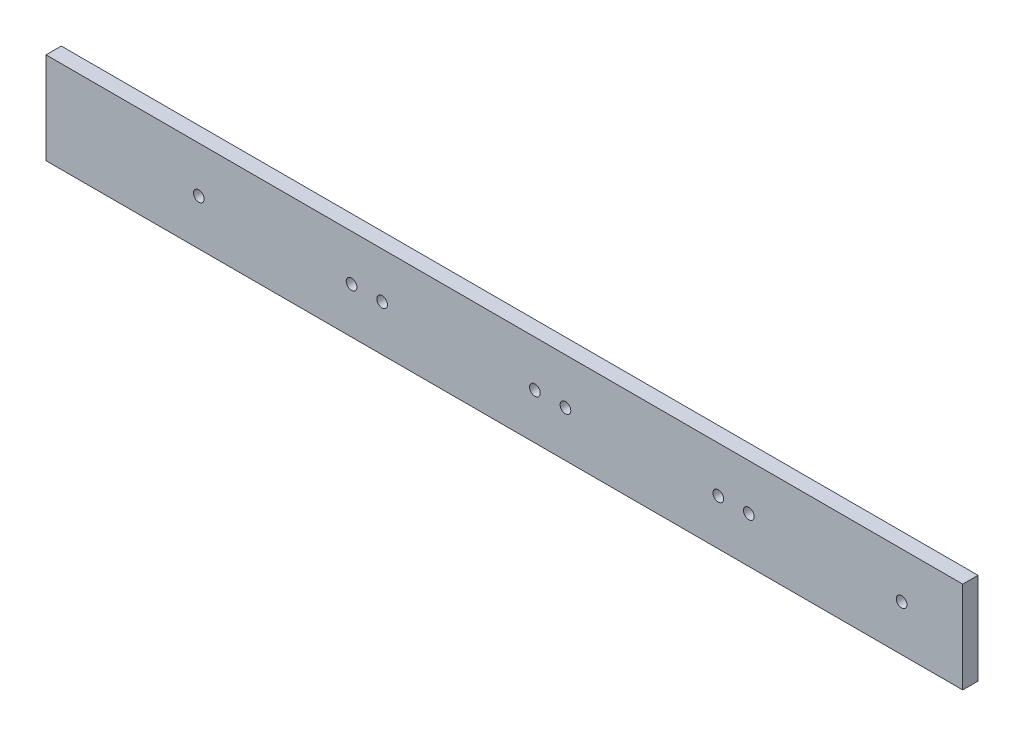
ISO-10303-21;
HEADER;
FILE_DESCRIPTION(('STEP AP214'),'2;1');
FILE_NAME('part.step','',(''),(''),'','','');
FILE_SCHEMA(('AUTOMOTIVE_DESIGN { 1 0 10303 214 1 1 1 1 }'));
ENDSEC;
DATA;
#1=APPLICATION_CONTEXT('core data for automotive mechanical design processes');
#2=APPLICATION_PROTOCOL_DEFINITION('international standard','automotive_design',2000,#1);
#3=PRODUCT_CONTEXT('',#1,'mechanical');
#4=PRODUCT('Part','Part','',(#3));
#5=PRODUCT_RELATED_PRODUCT_CATEGORY('part','',(#4));
#6=PRODUCT_DEFINITION_FORMATION('','',#4);
#7=PRODUCT_DEFINITION_CONTEXT('part definition',#1,'design');
#8=PRODUCT_DEFINITION('design','',#6,#7);
#9=PRODUCT_DEFINITION_SHAPE('','',#8);
#10=(LENGTH_UNIT() NAMED_UNIT(*) SI_UNIT(.MILLI.,.METRE.));
#11=(NAMED_UNIT(*) PLANE_ANGLE_UNIT() SI_UNIT($,.RADIAN.));
#12=(NAMED_UNIT(*) SI_UNIT($,.STERADIAN.) SOLID_ANGLE_UNIT());
#13=UNCERTAINTY_MEASURE_WITH_UNIT(LENGTH_MEASURE(1.E-05),#10,'distance_accuracy_value','');
#14=(GEOMETRIC_REPRESENTATION_CONTEXT(3) GLOBAL_UNCERTAINTY_ASSIGNED_CONTEXT((#13)) GLOBAL_UNIT_ASSIGNED_CONTEXT((#10,
#11,#12)) REPRESENTATION_CONTEXT('',''));
#15=CARTESIAN_POINT('',(0.,0.,0.));
#16=DIRECTION('',(0.,0.,1.));
#17=DIRECTION('',(1.,0.,0.));
#18=AXIS2_PLACEMENT_3D('',#15,#16,#17);
#19=CARTESIAN_POINT('',(0.,0.,5.));
#20=DIRECTION('',(1.,0.,0.));
#21=DIRECTION('',(0.,0.,-1.));
#22=AXIS2_PLACEMENT_3D('',#19,#20,#21);
#23=PLANE('',#22);
#24=DIRECTION('',(0.,-1.,0.));
#25=VECTOR('',#24,1.);
#26=CARTESIAN_POINT('',(0.,0.,0.));
#27=LINE('',#26,#25);
#28=CARTESIAN_POINT('',(0.,30.,0.));
#29=VERTEX_POINT('',#28);
#30=CARTESIAN_POINT('',(0.,0.,0.));
#31=VERTEX_POINT('',#30);
#32=EDGE_CURVE('E112',#29,#31,#27,.T.);
#33=ORIENTED_EDGE('',*,*,#32,.T.);
#34=DIRECTION('',(0.,0.,-1.));
#35=VECTOR('',#34,1.);
#36=CARTESIAN_POINT('',(0.,0.,5.));
#37=LINE('',#36,#35);
#38=CARTESIAN_POINT('',(0.,0.,5.));
#39=VERTEX_POINT('',#38);
#40=EDGE_CURVE('E13',#39,#31,#37,.T.);
#41=ORIENTED_EDGE('',*,*,#40,.F.);
#42=DIRECTION('',(0.,-1.,0.));
#43=VECTOR('',#42,1.);
#44=CARTESIAN_POINT('',(0.,0.,5.));
#45=LINE('',#44,#43);
#46=CARTESIAN_POINT('',(0.,30.,5.));
#47=VERTEX_POINT('',#46);
#48=EDGE_CURVE('E100',#47,#39,#45,.T.);
#49=ORIENTED_EDGE('',*,*,#48,.F.);
#50=DIRECTION('',(0.,0.,-1.));
#51=VECTOR('',#50,1.);
#52=CARTESIAN_POINT('',(0.,30.,5.));
#53=LINE('',#52,#51);
#54=EDGE_CURVE('E108',#47,#29,#53,.T.);
#55=ORIENTED_EDGE('',*,*,#54,.T.);
#56=EDGE_LOOP('',(#33,#41,#49,#55));
#57=FACE_BOUND('',#56,.T.);
#58=ADVANCED_FACE('F49',(#57),#23,.F.);
#59=CARTESIAN_POINT('',(0.,0.,5.));
#60=DIRECTION('',(0.,1.,0.));
#61=DIRECTION('',(0.,0.,1.));
#62=AXIS2_PLACEMENT_3D('',#59,#60,#61);
#63=PLANE('',#62);
#64=DIRECTION('',(1.,0.,0.));
#65=VECTOR('',#64,1.);
#66=CARTESIAN_POINT('',(0.,0.,0.));
#67=LINE('',#66,#65);
#68=CARTESIAN_POINT('',(300.,0.,0.));
#69=VERTEX_POINT('',#68);
#70=EDGE_CURVE('E104',#31,#69,#67,.T.);
#71=ORIENTED_EDGE('',*,*,#70,.T.);
#72=DIRECTION('',(0.,0.,-1.));
#73=VECTOR('',#72,1.);
#74=CARTESIAN_POINT('',(300.,0.,5.));
#75=LINE('',#74,#73);
#76=CARTESIAN_POINT('',(300.,0.,5.));
#77=VERTEX_POINT('',#76);
#78=EDGE_CURVE('E57',#77,#69,#75,.T.);
#79=ORIENTED_EDGE('',*,*,#78,.F.);
#80=DIRECTION('',(1.,0.,0.));
#81=VECTOR('',#80,1.);
#82=CARTESIAN_POINT('',(0.,0.,5.));
#83=LINE('',#82,#81);
#84=EDGE_CURVE('E95',#39,#77,#83,.T.);
#85=ORIENTED_EDGE('',*,*,#84,.F.);
#86=ORIENTED_EDGE('',*,*,#40,.T.);
#87=EDGE_LOOP('',(#71,#79,#85,#86));
#88=FACE_BOUND('',#87,.T.);
#89=ADVANCED_FACE('F103',(#88),#63,.F.);
#90=CARTESIAN_POINT('',(300.,0.,5.));
#91=DIRECTION('',(-1.,0.,0.));
#92=DIRECTION('',(0.,0.,1.));
#93=AXIS2_PLACEMENT_3D('',#90,#91,#92);
#94=PLANE('',#93);
#95=DIRECTION('',(0.,1.,0.));
#96=VECTOR('',#95,1.);
#97=CARTESIAN_POINT('',(300.,0.,0.));
#98=LINE('',#97,#96);
#99=CARTESIAN_POINT('',(300.,30.,0.));
#100=VERTEX_POINT('',#99);
#101=EDGE_CURVE('E82',#69,#100,#98,.T.);
#102=ORIENTED_EDGE('',*,*,#101,.T.);
#103=DIRECTION('',(0.,0.,-1.));
#104=VECTOR('',#103,1.);
#105=CARTESIAN_POINT('',(300.,30.,5.));
#106=LINE('',#105,#104);
#107=CARTESIAN_POINT('',(300.,30.,5.));
#108=VERTEX_POINT('',#107);
#109=EDGE_CURVE('E105',#108,#100,#106,.T.);
#110=ORIENTED_EDGE('',*,*,#109,.F.);
#111=DIRECTION('',(0.,1.,0.));
#112=VECTOR('',#111,1.);
#113=CARTESIAN_POINT('',(300.,0.,5.));
#114=LINE('',#113,#112);
#115=EDGE_CURVE('E98',#77,#108,#114,.T.);
#116=ORIENTED_EDGE('',*,*,#115,.F.);
#117=ORIENTED_EDGE('',*,*,#78,.T.);
#118=EDGE_LOOP('',(#102,#110,#116,#117));
#119=FACE_BOUND('',#118,.T.);
#120=ADVANCED_FACE('F106',(#119),#94,.F.);
#121=CARTESIAN_POINT('',(0.,30.,5.));
#122=DIRECTION('',(0.,-1.,0.));
#123=DIRECTION('',(0.,0.,-1.));
#124=AXIS2_PLACEMENT_3D('',#121,#122,#123);
#125=PLANE('',#124);
#126=DIRECTION('',(-1.,0.,0.));
#127=VECTOR('',#126,1.);
#128=CARTESIAN_POINT('',(0.,30.,0.));
#129=LINE('',#128,#127);
#130=EDGE_CURVE('E88',#100,#29,#129,.T.);
#131=ORIENTED_EDGE('',*,*,#130,.T.);
#132=ORIENTED_EDGE('',*,*,#54,.F.);
#133=DIRECTION('',(-1.,0.,0.));
#134=VECTOR('',#133,1.);
#135=CARTESIAN_POINT('',(0.,30.,5.));
#136=LINE('',#135,#134);
#137=EDGE_CURVE('E65',#108,#47,#136,.T.);
#138=ORIENTED_EDGE('',*,*,#137,.F.);
#139=ORIENTED_EDGE('',*,*,#109,.T.);
#140=EDGE_LOOP('',(#131,#132,#138,#139));
#141=FACE_BOUND('',#140,.T.);
#142=ADVANCED_FACE('F120',(#141),#125,.F.);
#143=CARTESIAN_POINT('',(0.,0.,5.));
#144=DIRECTION('',(0.,0.,-1.));
#145=DIRECTION('',(-1.,0.,0.));
#146=AXIS2_PLACEMENT_3D('',#143,#144,#145);
#147=PLANE('',#146);
#148=CARTESIAN_POINT('',(230.,14.9999999999996,5.));
#149=DIRECTION('',(0.,0.,1.));
#150=DIRECTION('',(1.,0.,0.));
#151=AXIS2_PLACEMENT_3D('',#148,#149,#150);
#152=CIRCLE('',#151,1.74999999999998);
#153=CARTESIAN_POINT('',(231.75,14.9999999999996,5.));
#154=VERTEX_POINT('',#153);
#155=EDGE_CURVE('E168',#154,#154,#152,.T.);
#156=ORIENTED_EDGE('',*,*,#155,.F.);
#157=EDGE_LOOP('',(#156));
#158=FACE_BOUND('',#157,.T.);
#159=CARTESIAN_POINT('',(220.,14.9999999999996,5.));
#160=DIRECTION('',(0.,0.,1.));
#161=DIRECTION('',(1.,0.,0.));
#162=AXIS2_PLACEMENT_3D('',#159,#160,#161);
#163=CIRCLE('',#162,1.74999999999998);
#164=CARTESIAN_POINT('',(221.75,14.9999999999996,5.));
#165=VERTEX_POINT('',#164);
#166=EDGE_CURVE('E162',#165,#165,#163,.T.);
#167=ORIENTED_EDGE('',*,*,#166,.F.);
#168=EDGE_LOOP('',(#167));
#169=FACE_BOUND('',#168,.T.);
#170=CARTESIAN_POINT('',(170.,14.9999999999992,5.));
#171=DIRECTION('',(0.,0.,1.));
#172=DIRECTION('',(1.,0.,0.));
#173=AXIS2_PLACEMENT_3D('',#170,#171,#172);
#174=CIRCLE('',#173,1.74999999999998);
#175=CARTESIAN_POINT('',(171.75,14.9999999999992,5.));
#176=VERTEX_POINT('',#175);
#177=EDGE_CURVE('E156',#176,#176,#174,.T.);
#178=ORIENTED_EDGE('',*,*,#177,.F.);
#179=EDGE_LOOP('',(#178));
#180=FACE_BOUND('',#179,.T.);
#181=CARTESIAN_POINT('',(160.,14.9999999999992,5.));
#182=DIRECTION('',(0.,0.,1.));
#183=DIRECTION('',(1.,0.,0.));
#184=AXIS2_PLACEMENT_3D('',#181,#182,#183);
#185=CIRCLE('',#184,1.74999999999998);
#186=CARTESIAN_POINT('',(161.75,14.9999999999992,5.));
#187=VERTEX_POINT('',#186);
#188=EDGE_CURVE('E150',#187,#187,#185,.T.);
#189=ORIENTED_EDGE('',*,*,#188,.F.);
#190=EDGE_LOOP('',(#189));
#191=FACE_BOUND('',#190,.T.);
#192=CARTESIAN_POINT('',(110.,14.9999999999988,5.));
#193=DIRECTION('',(0.,0.,1.));
#194=DIRECTION('',(1.,0.,0.));
#195=AXIS2_PLACEMENT_3D('',#192,#193,#194);
#196=CIRCLE('',#195,1.74999999999998);
#197=CARTESIAN_POINT('',(111.75,14.9999999999988,5.));
#198=VERTEX_POINT('',#197);
#199=EDGE_CURVE('E144',#198,#198,#196,.T.);
#200=ORIENTED_EDGE('',*,*,#199,.F.);
#201=EDGE_LOOP('',(#200));
#202=FACE_BOUND('',#201,.T.);
#203=CARTESIAN_POINT('',(100.,14.9999999999987,5.));
#204=DIRECTION('',(0.,0.,1.));
#205=DIRECTION('',(1.,0.,0.));
#206=AXIS2_PLACEMENT_3D('',#203,#204,#205);
#207=CIRCLE('',#206,1.74999999999998);
#208=CARTESIAN_POINT('',(101.75,14.9999999999987,5.));
#209=VERTEX_POINT('',#208);
#210=EDGE_CURVE('E138',#209,#209,#207,.T.);
#211=ORIENTED_EDGE('',*,*,#210,.F.);
#212=EDGE_LOOP('',(#211));
#213=FACE_BOUND('',#212,.T.);
#214=CARTESIAN_POINT('',(50.,14.9999999999984,5.));
#215=DIRECTION('',(0.,0.,1.));
#216=DIRECTION('',(1.,0.,0.));
#217=AXIS2_PLACEMENT_3D('',#214,#215,#216);
#218=CIRCLE('',#217,1.74999999999998);
#219=CARTESIAN_POINT('',(51.75,14.9999999999984,5.));
#220=VERTEX_POINT('',#219);
#221=EDGE_CURVE('E132',#220,#220,#218,.T.);
#222=ORIENTED_EDGE('',*,*,#221,.F.);
#223=EDGE_LOOP('',(#222));
#224=FACE_BOUND('',#223,.T.);
#225=CARTESIAN_POINT('',(280.,15.,5.));
#226=DIRECTION('',(0.,0.,1.));
#227=DIRECTION('',(1.,0.,0.));
#228=AXIS2_PLACEMENT_3D('',#225,#226,#227);
#229=CIRCLE('',#228,1.74999999999998);
#230=CARTESIAN_POINT('',(281.75,15.,5.));
#231=VERTEX_POINT('',#230);
#232=EDGE_CURVE('E126',#231,#231,#229,.T.);
#233=ORIENTED_EDGE('',*,*,#232,.F.);
#234=EDGE_LOOP('',(#233));
#235=FACE_BOUND('',#234,.T.);
#236=ORIENTED_EDGE('',*,*,#48,.T.);
#237=ORIENTED_EDGE('',*,*,#84,.T.);
#238=ORIENTED_EDGE('',*,*,#115,.T.);
#239=ORIENTED_EDGE('',*,*,#137,.T.);
#240=EDGE_LOOP('',(#236,#237,#238,#239));
#241=FACE_BOUND('',#240,.T.);
#242=ADVANCED_FACE('F96',(#158,#169,#180,#191,#202,#213,#224,#235,#241),#147,.F.);
#243=CARTESIAN_POINT('',(0.,0.,0.));
#244=DIRECTION('',(0.,0.,-1.));
#245=DIRECTION('',(-1.,0.,0.));
#246=AXIS2_PLACEMENT_3D('',#243,#244,#245);
#247=PLANE('',#246);
#248=CARTESIAN_POINT('',(230.,14.9999999999996,0.));
#249=DIRECTION('',(0.,0.,1.));
#250=DIRECTION('',(1.,0.,0.));
#251=AXIS2_PLACEMENT_3D('',#248,#249,#250);
#252=CIRCLE('',#251,1.74999999999998);
#253=CARTESIAN_POINT('',(231.75,14.9999999999996,0.));
#254=VERTEX_POINT('',#253);
#255=EDGE_CURVE('E129',#254,#254,#252,.T.);
#256=ORIENTED_EDGE('',*,*,#255,.T.);
#257=EDGE_LOOP('',(#256));
#258=FACE_BOUND('',#257,.T.);
#259=CARTESIAN_POINT('',(220.,14.9999999999996,0.));
#260=DIRECTION('',(0.,0.,1.));
#261=DIRECTION('',(1.,0.,0.));
#262=AXIS2_PLACEMENT_3D('',#259,#260,#261);
#263=CIRCLE('',#262,1.74999999999998);
#264=CARTESIAN_POINT('',(221.75,14.9999999999996,0.));
#265=VERTEX_POINT('',#264);
#266=EDGE_CURVE('E165',#265,#265,#263,.T.);
#267=ORIENTED_EDGE('',*,*,#266,.T.);
#268=EDGE_LOOP('',(#267));
#269=FACE_BOUND('',#268,.T.);
#270=CARTESIAN_POINT('',(170.,14.9999999999992,0.));
#271=DIRECTION('',(0.,0.,1.));
#272=DIRECTION('',(1.,0.,0.));
#273=AXIS2_PLACEMENT_3D('',#270,#271,#272);
#274=CIRCLE('',#273,1.74999999999998);
#275=CARTESIAN_POINT('',(171.75,14.9999999999992,0.));
#276=VERTEX_POINT('',#275);
#277=EDGE_CURVE('E159',#276,#276,#274,.T.);
#278=ORIENTED_EDGE('',*,*,#277,.T.);
#279=EDGE_LOOP('',(#278));
#280=FACE_BOUND('',#279,.T.);
#281=CARTESIAN_POINT('',(160.,14.9999999999992,0.));
#282=DIRECTION('',(0.,0.,1.));
#283=DIRECTION('',(1.,0.,0.));
#284=AXIS2_PLACEMENT_3D('',#281,#282,#283);
#285=CIRCLE('',#284,1.74999999999998);
#286=CARTESIAN_POINT('',(161.75,14.9999999999992,0.));
#287=VERTEX_POINT('',#286);
#288=EDGE_CURVE('E153',#287,#287,#285,.T.);
#289=ORIENTED_EDGE('',*,*,#288,.T.);
#290=EDGE_LOOP('',(#289));
#291=FACE_BOUND('',#290,.T.);
#292=CARTESIAN_POINT('',(110.,14.9999999999988,0.));
#293=DIRECTION('',(0.,0.,1.));
#294=DIRECTION('',(1.,0.,0.));
#295=AXIS2_PLACEMENT_3D('',#292,#293,#294);
#296=CIRCLE('',#295,1.74999999999998);
#297=CARTESIAN_POINT('',(111.75,14.9999999999988,0.));
#298=VERTEX_POINT('',#297);
#299=EDGE_CURVE('E147',#298,#298,#296,.T.);
#300=ORIENTED_EDGE('',*,*,#299,.T.);
#301=EDGE_LOOP('',(#300));
#302=FACE_BOUND('',#301,.T.);
#303=CARTESIAN_POINT('',(100.,14.9999999999987,0.));
#304=DIRECTION('',(0.,0.,1.));
#305=DIRECTION('',(1.,0.,0.));
#306=AXIS2_PLACEMENT_3D('',#303,#304,#305);
#307=CIRCLE('',#306,1.74999999999998);
#308=CARTESIAN_POINT('',(101.75,14.9999999999987,0.));
#309=VERTEX_POINT('',#308);
#310=EDGE_CURVE('E141',#309,#309,#307,.T.);
#311=ORIENTED_EDGE('',*,*,#310,.T.);
#312=EDGE_LOOP('',(#311));
#313=FACE_BOUND('',#312,.T.);
#314=CARTESIAN_POINT('',(50.,14.9999999999984,0.));
#315=DIRECTION('',(0.,0.,1.));
#316=DIRECTION('',(1.,0.,0.));
#317=AXIS2_PLACEMENT_3D('',#314,#315,#316);
#318=CIRCLE('',#317,1.74999999999998);
#319=CARTESIAN_POINT('',(51.75,14.9999999999984,0.));
#320=VERTEX_POINT('',#319);
#321=EDGE_CURVE('E135',#320,#320,#318,.T.);
#322=ORIENTED_EDGE('',*,*,#321,.T.);
#323=EDGE_LOOP('',(#322));
#324=FACE_BOUND('',#323,.T.);
#325=CARTESIAN_POINT('',(280.,15.,0.));
#326=DIRECTION('',(0.,0.,1.));
#327=DIRECTION('',(1.,0.,0.));
#328=AXIS2_PLACEMENT_3D('',#325,#326,#327);
#329=CIRCLE('',#328,1.74999999999998);
#330=CARTESIAN_POINT('',(281.75,15.,0.));
#331=VERTEX_POINT('',#330);
#332=EDGE_CURVE('E115',#331,#331,#329,.T.);
#333=ORIENTED_EDGE('',*,*,#332,.T.);
#334=EDGE_LOOP('',(#333));
#335=FACE_BOUND('',#334,.T.);
#336=ORIENTED_EDGE('',*,*,#32,.F.);
#337=ORIENTED_EDGE('',*,*,#130,.F.);
#338=ORIENTED_EDGE('',*,*,#101,.F.);
#339=ORIENTED_EDGE('',*,*,#70,.F.);
#340=EDGE_LOOP('',(#336,#337,#338,#339));
#341=FACE_BOUND('',#340,.T.);
#342=ADVANCED_FACE('F123',(#258,#269,#280,#291,#302,#313,#324,#335,#341),#247,.T.);
#343=CARTESIAN_POINT('',(280.,15.,0.));
#344=DIRECTION('',(0.,0.,1.));
#345=DIRECTION('',(1.,0.,0.));
#346=AXIS2_PLACEMENT_3D('',#343,#344,#345);
#347=CYLINDRICAL_SURFACE('',#346,1.74999999999998);
#348=ORIENTED_EDGE('',*,*,#332,.F.);
#349=EDGE_LOOP('',(#348));
#350=FACE_BOUND('',#349,.T.);
#351=ORIENTED_EDGE('',*,*,#232,.T.);
#352=EDGE_LOOP('',(#351));
#353=FACE_BOUND('',#352,.T.);
#354=ADVANCED_FACE('F200',(#350,#353),#347,.F.);
#355=CARTESIAN_POINT('',(50.,14.9999999999984,0.));
#356=DIRECTION('',(0.,0.,1.));
#357=DIRECTION('',(1.,0.,0.));
#358=AXIS2_PLACEMENT_3D('',#355,#356,#357);
#359=CYLINDRICAL_SURFACE('',#358,1.74999999999998);
#360=ORIENTED_EDGE('',*,*,#321,.F.);
#361=EDGE_LOOP('',(#360));
#362=FACE_BOUND('',#361,.T.);
#363=ORIENTED_EDGE('',*,*,#221,.T.);
#364=EDGE_LOOP('',(#363));
#365=FACE_BOUND('',#364,.T.);
#366=ADVANCED_FACE('F202',(#362,#365),#359,.F.);
#367=CARTESIAN_POINT('',(100.,14.9999999999987,0.));
#368=DIRECTION('',(0.,0.,1.));
#369=DIRECTION('',(1.,0.,0.));
#370=AXIS2_PLACEMENT_3D('',#367,#368,#369);
#371=CYLINDRICAL_SURFACE('',#370,1.74999999999998);
#372=ORIENTED_EDGE('',*,*,#310,.F.);
#373=EDGE_LOOP('',(#372));
#374=FACE_BOUND('',#373,.T.);
#375=ORIENTED_EDGE('',*,*,#210,.T.);
#376=EDGE_LOOP('',(#375));
#377=FACE_BOUND('',#376,.T.);
#378=ADVANCED_FACE('F209',(#374,#377),#371,.F.);
#379=CARTESIAN_POINT('',(110.,14.9999999999988,0.));
#380=DIRECTION('',(0.,0.,1.));
#381=DIRECTION('',(1.,0.,0.));
#382=AXIS2_PLACEMENT_3D('',#379,#380,#381);
#383=CYLINDRICAL_SURFACE('',#382,1.74999999999998);
#384=ORIENTED_EDGE('',*,*,#299,.F.);
#385=EDGE_LOOP('',(#384));
#386=FACE_BOUND('',#385,.T.);
#387=ORIENTED_EDGE('',*,*,#199,.T.);
#388=EDGE_LOOP('',(#387));
#389=FACE_BOUND('',#388,.T.);
#390=ADVANCED_FACE('F257',(#386,#389),#383,.F.);
#391=CARTESIAN_POINT('',(160.,14.9999999999992,0.));
#392=DIRECTION('',(0.,0.,1.));
#393=DIRECTION('',(1.,0.,0.));
#394=AXIS2_PLACEMENT_3D('',#391,#392,#393);
#395=CYLINDRICAL_SURFACE('',#394,1.74999999999998);
#396=ORIENTED_EDGE('',*,*,#288,.F.);
#397=EDGE_LOOP('',(#396));
#398=FACE_BOUND('',#397,.T.);
#399=ORIENTED_EDGE('',*,*,#188,.T.);
#400=EDGE_LOOP('',(#399));
#401=FACE_BOUND('',#400,.T.);
#402=ADVANCED_FACE('F267',(#398,#401),#395,.F.);
#403=CARTESIAN_POINT('',(170.,14.9999999999992,0.));
#404=DIRECTION('',(0.,0.,1.));
#405=DIRECTION('',(1.,0.,0.));
#406=AXIS2_PLACEMENT_3D('',#403,#404,#405);
#407=CYLINDRICAL_SURFACE('',#406,1.74999999999998);
#408=ORIENTED_EDGE('',*,*,#277,.F.);
#409=EDGE_LOOP('',(#408));
#410=FACE_BOUND('',#409,.T.);
#411=ORIENTED_EDGE('',*,*,#177,.T.);
#412=EDGE_LOOP('',(#411));
#413=FACE_BOUND('',#412,.T.);
#414=ADVANCED_FACE('F277',(#410,#413),#407,.F.);
#415=CARTESIAN_POINT('',(220.,14.9999999999996,0.));
#416=DIRECTION('',(0.,0.,1.));
#417=DIRECTION('',(1.,0.,0.));
#418=AXIS2_PLACEMENT_3D('',#415,#416,#417);
#419=CYLINDRICAL_SURFACE('',#418,1.74999999999998);
#420=ORIENTED_EDGE('',*,*,#266,.F.);
#421=EDGE_LOOP('',(#420));
#422=FACE_BOUND('',#421,.T.);
#423=ORIENTED_EDGE('',*,*,#166,.T.);
#424=EDGE_LOOP('',(#423));
#425=FACE_BOUND('',#424,.T.);
#426=ADVANCED_FACE('F179',(#422,#425),#419,.F.);
#427=CARTESIAN_POINT('',(230.,14.9999999999996,0.));
#428=DIRECTION('',(0.,0.,1.));
#429=DIRECTION('',(1.,0.,0.));
#430=AXIS2_PLACEMENT_3D('',#427,#428,#429);
#431=CYLINDRICAL_SURFACE('',#430,1.74999999999998);
#432=ORIENTED_EDGE('',*,*,#255,.F.);
#433=EDGE_LOOP('',(#432));
#434=FACE_BOUND('',#433,.T.);
#435=ORIENTED_EDGE('',*,*,#155,.T.);
#436=EDGE_LOOP('',(#435));
#437=FACE_BOUND('',#436,.T.);
#438=ADVANCED_FACE('F176',(#434,#437),#431,.F.);
#439=CLOSED_SHELL('',(#58,#89,#120,#142,#242,#342,#354,#366,#378,#390,#402,#414,#426,#438));
#440=MANIFOLD_SOLID_BREP('B2',#439);
#441=ADVANCED_BREP_SHAPE_REPRESENTATION('',(#18,#440),#14);
#442=SHAPE_DEFINITION_REPRESENTATION(#9,#441);
ENDSEC;
END-ISO-10303-21;
